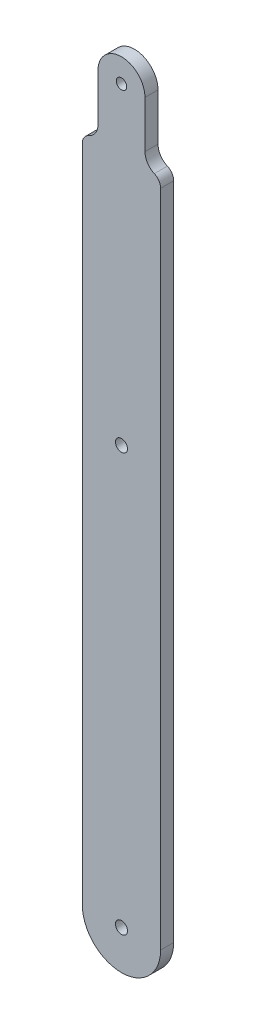
ISO-10303-21;
HEADER;
FILE_DESCRIPTION(('STEP AP214'),'2;1');
FILE_NAME('part.step','',(''),(''),'','','');
FILE_SCHEMA(('AUTOMOTIVE_DESIGN { 1 0 10303 214 1 1 1 1 }'));
ENDSEC;
DATA;
#1=APPLICATION_CONTEXT('core data for automotive mechanical design processes');
#2=APPLICATION_PROTOCOL_DEFINITION('international standard','automotive_design',2000,#1);
#3=PRODUCT_CONTEXT('',#1,'mechanical');
#4=PRODUCT('Part','Part','',(#3));
#5=PRODUCT_RELATED_PRODUCT_CATEGORY('part','',(#4));
#6=PRODUCT_DEFINITION_FORMATION('','',#4);
#7=PRODUCT_DEFINITION_CONTEXT('part definition',#1,'design');
#8=PRODUCT_DEFINITION('design','',#6,#7);
#9=PRODUCT_DEFINITION_SHAPE('','',#8);
#10=(LENGTH_UNIT() NAMED_UNIT(*) SI_UNIT(.MILLI.,.METRE.));
#11=(NAMED_UNIT(*) PLANE_ANGLE_UNIT() SI_UNIT($,.RADIAN.));
#12=(NAMED_UNIT(*) SI_UNIT($,.STERADIAN.) SOLID_ANGLE_UNIT());
#13=UNCERTAINTY_MEASURE_WITH_UNIT(LENGTH_MEASURE(1.E-05),#10,'distance_accuracy_value','');
#14=(GEOMETRIC_REPRESENTATION_CONTEXT(3) GLOBAL_UNCERTAINTY_ASSIGNED_CONTEXT((#13)) GLOBAL_UNIT_ASSIGNED_CONTEXT((#10,
#11,#12)) REPRESENTATION_CONTEXT('',''));
#15=CARTESIAN_POINT('',(0.,0.,0.));
#16=DIRECTION('',(0.,0.,1.));
#17=DIRECTION('',(1.,0.,0.));
#18=AXIS2_PLACEMENT_3D('',#15,#16,#17);
#19=CARTESIAN_POINT('',(-9.82801288749565,-25.4000001205939,3.175));
#20=DIRECTION('',(0.,0.,1.));
#21=DIRECTION('',(1.,0.,0.));
#22=AXIS2_PLACEMENT_3D('',#19,#20,#21);
#23=PLANE('',#22);
#24=CARTESIAN_POINT('',(-9.82801288749565,76.2,3.175));
#25=DIRECTION('',(0.,0.,1.));
#26=DIRECTION('',(1.,0.,0.));
#27=AXIS2_PLACEMENT_3D('',#24,#25,#26);
#28=CIRCLE('',#27,1.4605);
#29=CARTESIAN_POINT('',(-8.36751288749565,76.2,3.175));
#30=VERTEX_POINT('',#29);
#31=EDGE_CURVE('E221',#30,#30,#28,.T.);
#32=ORIENTED_EDGE('',*,*,#31,.F.);
#33=EDGE_LOOP('',(#32));
#34=FACE_BOUND('',#33,.T.);
#35=CARTESIAN_POINT('',(-9.82801288749568,152.4,3.175));
#36=DIRECTION('',(0.,0.,1.));
#37=DIRECTION('',(1.,0.,0.));
#38=AXIS2_PLACEMENT_3D('',#35,#36,#37);
#39=CIRCLE('',#38,1.27);
#40=CARTESIAN_POINT('',(-8.55801288749568,152.4,3.175));
#41=VERTEX_POINT('',#40);
#42=EDGE_CURVE('E146',#41,#41,#39,.T.);
#43=ORIENTED_EDGE('',*,*,#42,.F.);
#44=EDGE_LOOP('',(#43));
#45=FACE_BOUND('',#44,.T.);
#46=CARTESIAN_POINT('',(-9.82801288749565,-25.4000001205939,3.175));
#47=DIRECTION('',(0.,0.,1.));
#48=DIRECTION('',(1.,0.,0.));
#49=AXIS2_PLACEMENT_3D('',#46,#47,#48);
#50=CIRCLE('',#49,9.52499999999998);
#51=CARTESIAN_POINT('',(-19.3530128874956,-25.4000001205939,3.175));
#52=VERTEX_POINT('',#51);
#53=CARTESIAN_POINT('',(-0.303012887495665,-25.4000001205939,3.175));
#54=VERTEX_POINT('',#53);
#55=EDGE_CURVE('E161',#52,#54,#50,.T.);
#56=ORIENTED_EDGE('',*,*,#55,.T.);
#57=DIRECTION('',(0.,1.,0.));
#58=VECTOR('',#57,1.);
#59=CARTESIAN_POINT('',(-0.303012887495665,-25.4000001205939,3.175));
#60=LINE('',#59,#58);
#61=CARTESIAN_POINT('',(-0.303012887495672,135.150128867406,3.175));
#62=VERTEX_POINT('',#61);
#63=EDGE_CURVE('E99',#54,#62,#60,.T.);
#64=ORIENTED_EDGE('',*,*,#63,.T.);
#65=CARTESIAN_POINT('',(-2.84301288749568,135.150128867406,3.175));
#66=DIRECTION('',(0.,0.,1.));
#67=DIRECTION('',(-1.,0.,0.));
#68=AXIS2_PLACEMENT_3D('',#65,#66,#67);
#69=CIRCLE('',#68,2.54);
#70=CARTESIAN_POINT('',(-1.82701288749568,137.478077320444,3.175));
#71=VERTEX_POINT('',#70);
#72=EDGE_CURVE('E182',#62,#71,#69,.T.);
#73=ORIENTED_EDGE('',*,*,#72,.T.);
#74=CARTESIAN_POINT('',(-0.303012887495684,140.97,3.175));
#75=DIRECTION('',(0.,0.,-1.));
#76=DIRECTION('',(1.,0.,0.));
#77=AXIS2_PLACEMENT_3D('',#74,#75,#76);
#78=CIRCLE('',#77,3.80999999999999);
#79=CARTESIAN_POINT('',(-4.11301288749568,140.97,3.175));
#80=VERTEX_POINT('',#79);
#81=EDGE_CURVE('E201',#71,#80,#78,.T.);
#82=ORIENTED_EDGE('',*,*,#81,.T.);
#83=DIRECTION('',(0.,1.,0.));
#84=VECTOR('',#83,1.);
#85=CARTESIAN_POINT('',(-4.11301288749568,152.4,3.175));
#86=LINE('',#85,#84);
#87=CARTESIAN_POINT('',(-4.11301288749568,152.4,3.175));
#88=VERTEX_POINT('',#87);
#89=EDGE_CURVE('E198',#80,#88,#86,.T.);
#90=ORIENTED_EDGE('',*,*,#89,.T.);
#91=CARTESIAN_POINT('',(-9.82801288749568,152.4,3.175));
#92=DIRECTION('',(0.,0.,1.));
#93=DIRECTION('',(-1.,0.,0.));
#94=AXIS2_PLACEMENT_3D('',#91,#92,#93);
#95=CIRCLE('',#94,5.715);
#96=CARTESIAN_POINT('',(-15.5430128874957,152.4,3.175));
#97=VERTEX_POINT('',#96);
#98=EDGE_CURVE('E200',#88,#97,#95,.T.);
#99=ORIENTED_EDGE('',*,*,#98,.T.);
#100=DIRECTION('',(0.,-1.,0.));
#101=VECTOR('',#100,1.);
#102=CARTESIAN_POINT('',(-15.5430128874957,152.4,3.175));
#103=LINE('',#102,#101);
#104=CARTESIAN_POINT('',(-15.5430128874957,140.97,3.175));
#105=VERTEX_POINT('',#104);
#106=EDGE_CURVE('E124',#97,#105,#103,.T.);
#107=ORIENTED_EDGE('',*,*,#106,.T.);
#108=CARTESIAN_POINT('',(-19.3530128874957,140.97,3.175));
#109=DIRECTION('',(0.,0.,-1.));
#110=DIRECTION('',(-1.,0.,0.));
#111=AXIS2_PLACEMENT_3D('',#108,#109,#110);
#112=CIRCLE('',#111,3.80999999999999);
#113=CARTESIAN_POINT('',(-17.8290128874957,137.478077320444,3.175));
#114=VERTEX_POINT('',#113);
#115=EDGE_CURVE('E118',#105,#114,#112,.T.);
#116=ORIENTED_EDGE('',*,*,#115,.T.);
#117=CARTESIAN_POINT('',(-16.8130128874956,135.150128867406,3.175));
#118=DIRECTION('',(0.,0.,1.));
#119=DIRECTION('',(1.,0.,0.));
#120=AXIS2_PLACEMENT_3D('',#117,#118,#119);
#121=CIRCLE('',#120,2.53999999999999);
#122=CARTESIAN_POINT('',(-19.3530128874956,135.150128867406,3.175));
#123=VERTEX_POINT('',#122);
#124=EDGE_CURVE('E122',#114,#123,#121,.T.);
#125=ORIENTED_EDGE('',*,*,#124,.T.);
#126=DIRECTION('',(0.,-1.,0.));
#127=VECTOR('',#126,1.);
#128=CARTESIAN_POINT('',(-19.3530128874956,135.150128867406,3.175));
#129=LINE('',#128,#127);
#130=EDGE_CURVE('E50',#123,#52,#129,.T.);
#131=ORIENTED_EDGE('',*,*,#130,.T.);
#132=EDGE_LOOP('',(#56,#64,#73,#82,#90,#99,#107,#116,#125,#131));
#133=FACE_BOUND('',#132,.T.);
#134=CARTESIAN_POINT('',(-9.82801288749565,-25.4000001205939,3.175));
#135=DIRECTION('',(0.,0.,1.));
#136=DIRECTION('',(1.,0.,0.));
#137=AXIS2_PLACEMENT_3D('',#134,#135,#136);
#138=CIRCLE('',#137,1.4605);
#139=CARTESIAN_POINT('',(-8.36751288749565,-25.4000001205939,3.175));
#140=VERTEX_POINT('',#139);
#141=EDGE_CURVE('E212',#140,#140,#138,.T.);
#142=ORIENTED_EDGE('',*,*,#141,.F.);
#143=EDGE_LOOP('',(#142));
#144=FACE_BOUND('',#143,.T.);
#145=ADVANCED_FACE('F33',(#34,#45,#133,#144),#23,.T.);
#146=CARTESIAN_POINT('',(-9.82801288749565,-25.4000001205939,0.));
#147=DIRECTION('',(0.,0.,1.));
#148=DIRECTION('',(1.,0.,0.));
#149=AXIS2_PLACEMENT_3D('',#146,#147,#148);
#150=PLANE('',#149);
#151=CARTESIAN_POINT('',(-9.82801288749565,76.2,0.));
#152=DIRECTION('',(0.,0.,1.));
#153=DIRECTION('',(1.,0.,0.));
#154=AXIS2_PLACEMENT_3D('',#151,#152,#153);
#155=CIRCLE('',#154,1.4605);
#156=CARTESIAN_POINT('',(-8.36751288749565,76.2,0.));
#157=VERTEX_POINT('',#156);
#158=EDGE_CURVE('E218',#157,#157,#155,.T.);
#159=ORIENTED_EDGE('',*,*,#158,.T.);
#160=EDGE_LOOP('',(#159));
#161=FACE_BOUND('',#160,.T.);
#162=CARTESIAN_POINT('',(-9.82801288749565,-25.4000001205939,0.));
#163=DIRECTION('',(0.,0.,1.));
#164=DIRECTION('',(1.,0.,0.));
#165=AXIS2_PLACEMENT_3D('',#162,#163,#164);
#166=CIRCLE('',#165,9.52499999999998);
#167=CARTESIAN_POINT('',(-19.3530128874956,-25.4000001205939,0.));
#168=VERTEX_POINT('',#167);
#169=CARTESIAN_POINT('',(-0.303012887495665,-25.4000001205939,0.));
#170=VERTEX_POINT('',#169);
#171=EDGE_CURVE('E142',#168,#170,#166,.T.);
#172=ORIENTED_EDGE('',*,*,#171,.F.);
#173=DIRECTION('',(0.,-1.,0.));
#174=VECTOR('',#173,1.);
#175=CARTESIAN_POINT('',(-19.3530128874956,135.150128867406,0.));
#176=LINE('',#175,#174);
#177=CARTESIAN_POINT('',(-19.3530128874956,135.150128867406,0.));
#178=VERTEX_POINT('',#177);
#179=EDGE_CURVE('E91',#178,#168,#176,.T.);
#180=ORIENTED_EDGE('',*,*,#179,.F.);
#181=CARTESIAN_POINT('',(-16.8130128874956,135.150128867406,0.));
#182=DIRECTION('',(0.,0.,1.));
#183=DIRECTION('',(1.,0.,0.));
#184=AXIS2_PLACEMENT_3D('',#181,#182,#183);
#185=CIRCLE('',#184,2.53999999999999);
#186=CARTESIAN_POINT('',(-17.8290128874957,137.478077320444,0.));
#187=VERTEX_POINT('',#186);
#188=EDGE_CURVE('E85',#187,#178,#185,.T.);
#189=ORIENTED_EDGE('',*,*,#188,.F.);
#190=CARTESIAN_POINT('',(-19.3530128874957,140.97,0.));
#191=DIRECTION('',(0.,0.,-1.));
#192=DIRECTION('',(-1.,0.,0.));
#193=AXIS2_PLACEMENT_3D('',#190,#191,#192);
#194=CIRCLE('',#193,3.80999999999999);
#195=CARTESIAN_POINT('',(-15.5430128874957,140.97,0.));
#196=VERTEX_POINT('',#195);
#197=EDGE_CURVE('E132',#196,#187,#194,.T.);
#198=ORIENTED_EDGE('',*,*,#197,.F.);
#199=DIRECTION('',(0.,-1.,0.));
#200=VECTOR('',#199,1.);
#201=CARTESIAN_POINT('',(-15.5430128874957,152.4,0.));
#202=LINE('',#201,#200);
#203=CARTESIAN_POINT('',(-15.5430128874957,152.4,0.));
#204=VERTEX_POINT('',#203);
#205=EDGE_CURVE('E156',#204,#196,#202,.T.);
#206=ORIENTED_EDGE('',*,*,#205,.F.);
#207=CARTESIAN_POINT('',(-9.82801288749568,152.4,0.));
#208=DIRECTION('',(0.,0.,1.));
#209=DIRECTION('',(-1.,0.,0.));
#210=AXIS2_PLACEMENT_3D('',#207,#208,#209);
#211=CIRCLE('',#210,5.715);
#212=CARTESIAN_POINT('',(-4.11301288749568,152.4,0.));
#213=VERTEX_POINT('',#212);
#214=EDGE_CURVE('E154',#213,#204,#211,.T.);
#215=ORIENTED_EDGE('',*,*,#214,.F.);
#216=DIRECTION('',(0.,1.,0.));
#217=VECTOR('',#216,1.);
#218=CARTESIAN_POINT('',(-4.11301288749568,152.4,0.));
#219=LINE('',#218,#217);
#220=CARTESIAN_POINT('',(-4.11301288749568,140.97,0.));
#221=VERTEX_POINT('',#220);
#222=EDGE_CURVE('E152',#221,#213,#219,.T.);
#223=ORIENTED_EDGE('',*,*,#222,.F.);
#224=CARTESIAN_POINT('',(-0.303012887495684,140.97,0.));
#225=DIRECTION('',(0.,0.,-1.));
#226=DIRECTION('',(1.,0.,0.));
#227=AXIS2_PLACEMENT_3D('',#224,#225,#226);
#228=CIRCLE('',#227,3.80999999999999);
#229=CARTESIAN_POINT('',(-1.82701288749568,137.478077320444,0.));
#230=VERTEX_POINT('',#229);
#231=EDGE_CURVE('E150',#230,#221,#228,.T.);
#232=ORIENTED_EDGE('',*,*,#231,.F.);
#233=CARTESIAN_POINT('',(-2.84301288749568,135.150128867406,0.));
#234=DIRECTION('',(0.,0.,1.));
#235=DIRECTION('',(-1.,0.,0.));
#236=AXIS2_PLACEMENT_3D('',#233,#234,#235);
#237=CIRCLE('',#236,2.54);
#238=CARTESIAN_POINT('',(-0.303012887495672,135.150128867406,0.));
#239=VERTEX_POINT('',#238);
#240=EDGE_CURVE('E148',#239,#230,#237,.T.);
#241=ORIENTED_EDGE('',*,*,#240,.F.);
#242=DIRECTION('',(0.,1.,0.));
#243=VECTOR('',#242,1.);
#244=CARTESIAN_POINT('',(-0.303012887495665,-25.4000001205939,0.));
#245=LINE('',#244,#243);
#246=EDGE_CURVE('E145',#170,#239,#245,.T.);
#247=ORIENTED_EDGE('',*,*,#246,.F.);
#248=EDGE_LOOP('',(#172,#180,#189,#198,#206,#215,#223,#232,#241,#247));
#249=FACE_BOUND('',#248,.T.);
#250=CARTESIAN_POINT('',(-9.82801288749568,152.4,0.));
#251=DIRECTION('',(0.,0.,1.));
#252=DIRECTION('',(1.,0.,0.));
#253=AXIS2_PLACEMENT_3D('',#250,#251,#252);
#254=CIRCLE('',#253,1.27);
#255=CARTESIAN_POINT('',(-8.55801288749568,152.4,0.));
#256=VERTEX_POINT('',#255);
#257=EDGE_CURVE('E209',#256,#256,#254,.T.);
#258=ORIENTED_EDGE('',*,*,#257,.T.);
#259=EDGE_LOOP('',(#258));
#260=FACE_BOUND('',#259,.T.);
#261=CARTESIAN_POINT('',(-9.82801288749565,-25.4000001205939,0.));
#262=DIRECTION('',(0.,0.,1.));
#263=DIRECTION('',(1.,0.,0.));
#264=AXIS2_PLACEMENT_3D('',#261,#262,#263);
#265=CIRCLE('',#264,1.4605);
#266=CARTESIAN_POINT('',(-8.36751288749565,-25.4000001205939,0.));
#267=VERTEX_POINT('',#266);
#268=EDGE_CURVE('E215',#267,#267,#265,.T.);
#269=ORIENTED_EDGE('',*,*,#268,.T.);
#270=EDGE_LOOP('',(#269));
#271=FACE_BOUND('',#270,.T.);
#272=ADVANCED_FACE('F186',(#161,#249,#260,#271),#150,.F.);
#273=CARTESIAN_POINT('',(-9.82801288749565,-25.4000001205939,3.175));
#274=DIRECTION('',(0.,0.,-1.));
#275=DIRECTION('',(-1.,0.,0.));
#276=AXIS2_PLACEMENT_3D('',#273,#274,#275);
#277=CYLINDRICAL_SURFACE('',#276,9.52499999999998);
#278=ORIENTED_EDGE('',*,*,#171,.T.);
#279=DIRECTION('',(0.,0.,-1.));
#280=VECTOR('',#279,1.);
#281=CARTESIAN_POINT('',(-0.303012887495665,-25.4000001205939,3.175));
#282=LINE('',#281,#280);
#283=EDGE_CURVE('E11',#54,#170,#282,.T.);
#284=ORIENTED_EDGE('',*,*,#283,.F.);
#285=ORIENTED_EDGE('',*,*,#55,.F.);
#286=DIRECTION('',(0.,0.,-1.));
#287=VECTOR('',#286,1.);
#288=CARTESIAN_POINT('',(-19.3530128874956,-25.4000001205939,3.175));
#289=LINE('',#288,#287);
#290=EDGE_CURVE('E138',#52,#168,#289,.T.);
#291=ORIENTED_EDGE('',*,*,#290,.T.);
#292=EDGE_LOOP('',(#278,#284,#285,#291));
#293=FACE_BOUND('',#292,.T.);
#294=ADVANCED_FACE('F35',(#293),#277,.T.);
#295=CARTESIAN_POINT('',(-0.303012887495665,-25.4000001205939,3.175));
#296=DIRECTION('',(-1.,0.,0.));
#297=DIRECTION('',(0.,-1.,0.));
#298=AXIS2_PLACEMENT_3D('',#295,#296,#297);
#299=PLANE('',#298);
#300=ORIENTED_EDGE('',*,*,#246,.T.);
#301=DIRECTION('',(0.,0.,-1.));
#302=VECTOR('',#301,1.);
#303=CARTESIAN_POINT('',(-0.303012887495672,135.150128867406,3.175));
#304=LINE('',#303,#302);
#305=EDGE_CURVE('E42',#62,#239,#304,.T.);
#306=ORIENTED_EDGE('',*,*,#305,.F.);
#307=ORIENTED_EDGE('',*,*,#63,.F.);
#308=ORIENTED_EDGE('',*,*,#283,.T.);
#309=EDGE_LOOP('',(#300,#306,#307,#308));
#310=FACE_BOUND('',#309,.T.);
#311=ADVANCED_FACE('F276',(#310),#299,.F.);
#312=CARTESIAN_POINT('',(-2.84301288749568,135.150128867406,3.175));
#313=DIRECTION('',(0.,0.,-1.));
#314=DIRECTION('',(-1.,0.,0.));
#315=AXIS2_PLACEMENT_3D('',#312,#313,#314);
#316=CYLINDRICAL_SURFACE('',#315,2.54);
#317=ORIENTED_EDGE('',*,*,#240,.T.);
#318=DIRECTION('',(0.,0.,-1.));
#319=VECTOR('',#318,1.);
#320=CARTESIAN_POINT('',(-1.82701288749568,137.478077320444,3.175));
#321=LINE('',#320,#319);
#322=EDGE_CURVE('E174',#71,#230,#321,.T.);
#323=ORIENTED_EDGE('',*,*,#322,.F.);
#324=ORIENTED_EDGE('',*,*,#72,.F.);
#325=ORIENTED_EDGE('',*,*,#305,.T.);
#326=EDGE_LOOP('',(#317,#323,#324,#325));
#327=FACE_BOUND('',#326,.T.);
#328=ADVANCED_FACE('F180',(#327),#316,.T.);
#329=CARTESIAN_POINT('',(-0.303012887495684,140.97,3.175));
#330=DIRECTION('',(0.,0.,-1.));
#331=DIRECTION('',(-1.,0.,0.));
#332=AXIS2_PLACEMENT_3D('',#329,#330,#331);
#333=CYLINDRICAL_SURFACE('',#332,3.80999999999999);
#334=ORIENTED_EDGE('',*,*,#231,.T.);
#335=DIRECTION('',(0.,0.,-1.));
#336=VECTOR('',#335,1.);
#337=CARTESIAN_POINT('',(-4.11301288749568,140.97,3.175));
#338=LINE('',#337,#336);
#339=EDGE_CURVE('E171',#80,#221,#338,.T.);
#340=ORIENTED_EDGE('',*,*,#339,.F.);
#341=ORIENTED_EDGE('',*,*,#81,.F.);
#342=ORIENTED_EDGE('',*,*,#322,.T.);
#343=EDGE_LOOP('',(#334,#340,#341,#342));
#344=FACE_BOUND('',#343,.T.);
#345=ADVANCED_FACE('F192',(#344),#333,.F.);
#346=CARTESIAN_POINT('',(-4.11301288749568,152.4,3.175));
#347=DIRECTION('',(-1.,0.,0.));
#348=DIRECTION('',(0.,0.,1.));
#349=AXIS2_PLACEMENT_3D('',#346,#347,#348);
#350=PLANE('',#349);
#351=ORIENTED_EDGE('',*,*,#222,.T.);
#352=DIRECTION('',(0.,0.,-1.));
#353=VECTOR('',#352,1.);
#354=CARTESIAN_POINT('',(-4.11301288749568,152.4,3.175));
#355=LINE('',#354,#353);
#356=EDGE_CURVE('E168',#88,#213,#355,.T.);
#357=ORIENTED_EDGE('',*,*,#356,.F.);
#358=ORIENTED_EDGE('',*,*,#89,.F.);
#359=ORIENTED_EDGE('',*,*,#339,.T.);
#360=EDGE_LOOP('',(#351,#357,#358,#359));
#361=FACE_BOUND('',#360,.T.);
#362=ADVANCED_FACE('F196',(#361),#350,.F.);
#363=CARTESIAN_POINT('',(-9.82801288749568,152.4,3.175));
#364=DIRECTION('',(0.,0.,-1.));
#365=DIRECTION('',(-1.,0.,0.));
#366=AXIS2_PLACEMENT_3D('',#363,#364,#365);
#367=CYLINDRICAL_SURFACE('',#366,5.715);
#368=ORIENTED_EDGE('',*,*,#214,.T.);
#369=DIRECTION('',(0.,0.,-1.));
#370=VECTOR('',#369,1.);
#371=CARTESIAN_POINT('',(-15.5430128874957,152.4,3.175));
#372=LINE('',#371,#370);
#373=EDGE_CURVE('E165',#97,#204,#372,.T.);
#374=ORIENTED_EDGE('',*,*,#373,.F.);
#375=ORIENTED_EDGE('',*,*,#98,.F.);
#376=ORIENTED_EDGE('',*,*,#356,.T.);
#377=EDGE_LOOP('',(#368,#374,#375,#376));
#378=FACE_BOUND('',#377,.T.);
#379=ADVANCED_FACE('F266',(#378),#367,.T.);
#380=CARTESIAN_POINT('',(-15.5430128874957,152.4,3.175));
#381=DIRECTION('',(1.,0.,0.));
#382=DIRECTION('',(0.,0.,-1.));
#383=AXIS2_PLACEMENT_3D('',#380,#381,#382);
#384=PLANE('',#383);
#385=ORIENTED_EDGE('',*,*,#205,.T.);
#386=DIRECTION('',(0.,0.,-1.));
#387=VECTOR('',#386,1.);
#388=CARTESIAN_POINT('',(-15.5430128874957,140.97,3.175));
#389=LINE('',#388,#387);
#390=EDGE_CURVE('E133',#105,#196,#389,.T.);
#391=ORIENTED_EDGE('',*,*,#390,.F.);
#392=ORIENTED_EDGE('',*,*,#106,.F.);
#393=ORIENTED_EDGE('',*,*,#373,.T.);
#394=EDGE_LOOP('',(#385,#391,#392,#393));
#395=FACE_BOUND('',#394,.T.);
#396=ADVANCED_FACE('F263',(#395),#384,.F.);
#397=CARTESIAN_POINT('',(-19.3530128874957,140.97,3.175));
#398=DIRECTION('',(0.,0.,-1.));
#399=DIRECTION('',(-1.,0.,0.));
#400=AXIS2_PLACEMENT_3D('',#397,#398,#399);
#401=CYLINDRICAL_SURFACE('',#400,3.80999999999999);
#402=ORIENTED_EDGE('',*,*,#197,.T.);
#403=DIRECTION('',(0.,0.,-1.));
#404=VECTOR('',#403,1.);
#405=CARTESIAN_POINT('',(-17.8290128874957,137.478077320444,3.175));
#406=LINE('',#405,#404);
#407=EDGE_CURVE('E129',#114,#187,#406,.T.);
#408=ORIENTED_EDGE('',*,*,#407,.F.);
#409=ORIENTED_EDGE('',*,*,#115,.F.);
#410=ORIENTED_EDGE('',*,*,#390,.T.);
#411=EDGE_LOOP('',(#402,#408,#409,#410));
#412=FACE_BOUND('',#411,.T.);
#413=ADVANCED_FACE('F130',(#412),#401,.F.);
#414=CARTESIAN_POINT('',(-16.8130128874956,135.150128867406,3.175));
#415=DIRECTION('',(0.,0.,-1.));
#416=DIRECTION('',(-1.,0.,0.));
#417=AXIS2_PLACEMENT_3D('',#414,#415,#416);
#418=CYLINDRICAL_SURFACE('',#417,2.53999999999999);
#419=ORIENTED_EDGE('',*,*,#188,.T.);
#420=DIRECTION('',(0.,0.,-1.));
#421=VECTOR('',#420,1.);
#422=CARTESIAN_POINT('',(-19.3530128874956,135.150128867406,3.175));
#423=LINE('',#422,#421);
#424=EDGE_CURVE('E134',#123,#178,#423,.T.);
#425=ORIENTED_EDGE('',*,*,#424,.F.);
#426=ORIENTED_EDGE('',*,*,#124,.F.);
#427=ORIENTED_EDGE('',*,*,#407,.T.);
#428=EDGE_LOOP('',(#419,#425,#426,#427));
#429=FACE_BOUND('',#428,.T.);
#430=ADVANCED_FACE('F136',(#429),#418,.T.);
#431=CARTESIAN_POINT('',(-19.3530128874956,135.150128867406,3.175));
#432=DIRECTION('',(1.,0.,0.));
#433=DIRECTION('',(0.,1.,0.));
#434=AXIS2_PLACEMENT_3D('',#431,#432,#433);
#435=PLANE('',#434);
#436=ORIENTED_EDGE('',*,*,#179,.T.);
#437=ORIENTED_EDGE('',*,*,#290,.F.);
#438=ORIENTED_EDGE('',*,*,#130,.F.);
#439=ORIENTED_EDGE('',*,*,#424,.T.);
#440=EDGE_LOOP('',(#436,#437,#438,#439));
#441=FACE_BOUND('',#440,.T.);
#442=ADVANCED_FACE('F243',(#441),#435,.F.);
#443=CARTESIAN_POINT('',(-9.82801288749568,152.4,3.175));
#444=DIRECTION('',(0.,0.,-1.));
#445=DIRECTION('',(-1.,0.,0.));
#446=AXIS2_PLACEMENT_3D('',#443,#444,#445);
#447=CYLINDRICAL_SURFACE('',#446,1.27);
#448=ORIENTED_EDGE('',*,*,#42,.T.);
#449=EDGE_LOOP('',(#448));
#450=FACE_BOUND('',#449,.T.);
#451=ORIENTED_EDGE('',*,*,#257,.F.);
#452=EDGE_LOOP('',(#451));
#453=FACE_BOUND('',#452,.T.);
#454=ADVANCED_FACE('F240',(#450,#453),#447,.F.);
#455=CARTESIAN_POINT('',(-9.82801288749565,-25.4000001205939,3.175));
#456=DIRECTION('',(0.,0.,-1.));
#457=DIRECTION('',(-1.,0.,0.));
#458=AXIS2_PLACEMENT_3D('',#455,#456,#457);
#459=CYLINDRICAL_SURFACE('',#458,1.4605);
#460=ORIENTED_EDGE('',*,*,#141,.T.);
#461=EDGE_LOOP('',(#460));
#462=FACE_BOUND('',#461,.T.);
#463=ORIENTED_EDGE('',*,*,#268,.F.);
#464=EDGE_LOOP('',(#463));
#465=FACE_BOUND('',#464,.T.);
#466=ADVANCED_FACE('F231',(#462,#465),#459,.F.);
#467=CARTESIAN_POINT('',(-9.82801288749565,76.2,0.));
#468=DIRECTION('',(0.,0.,1.));
#469=DIRECTION('',(1.,0.,0.));
#470=AXIS2_PLACEMENT_3D('',#467,#468,#469);
#471=CYLINDRICAL_SURFACE('',#470,1.4605);
#472=ORIENTED_EDGE('',*,*,#158,.F.);
#473=EDGE_LOOP('',(#472));
#474=FACE_BOUND('',#473,.T.);
#475=ORIENTED_EDGE('',*,*,#31,.T.);
#476=EDGE_LOOP('',(#475));
#477=FACE_BOUND('',#476,.T.);
#478=ADVANCED_FACE('F228',(#474,#477),#471,.F.);
#479=CLOSED_SHELL('',(#145,#272,#294,#311,#328,#345,#362,#379,#396,#413,#430,#442,#454,#466,#478));
#480=MANIFOLD_SOLID_BREP('B2',#479);
#481=ADVANCED_BREP_SHAPE_REPRESENTATION('',(#18,#480),#14);
#482=SHAPE_DEFINITION_REPRESENTATION(#9,#481);
ENDSEC;
END-ISO-10303-21;
